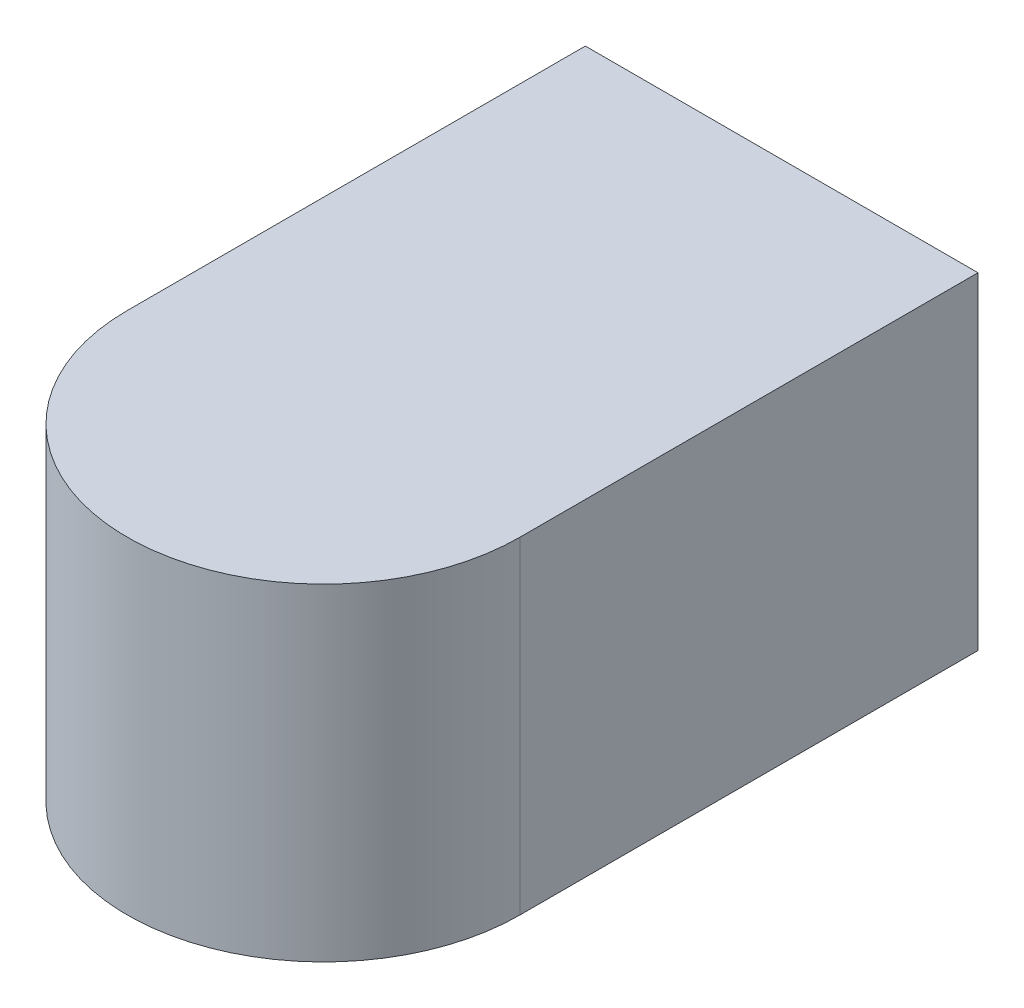
ISO-10303-21;
HEADER;
FILE_DESCRIPTION(('STEP AP214'),'2;1');
FILE_NAME('part.step','',(''),(''),'','','');
FILE_SCHEMA(('AUTOMOTIVE_DESIGN { 1 0 10303 214 1 1 1 1 }'));
ENDSEC;
DATA;
#1=APPLICATION_CONTEXT('core data for automotive mechanical design processes');
#2=APPLICATION_PROTOCOL_DEFINITION('international standard','automotive_design',2000,#1);
#3=PRODUCT_CONTEXT('',#1,'mechanical');
#4=PRODUCT('Part','Part','',(#3));
#5=PRODUCT_RELATED_PRODUCT_CATEGORY('part','',(#4));
#6=PRODUCT_DEFINITION_FORMATION('','',#4);
#7=PRODUCT_DEFINITION_CONTEXT('part definition',#1,'design');
#8=PRODUCT_DEFINITION('design','',#6,#7);
#9=PRODUCT_DEFINITION_SHAPE('','',#8);
#10=(LENGTH_UNIT() NAMED_UNIT(*) SI_UNIT(.MILLI.,.METRE.));
#11=(NAMED_UNIT(*) PLANE_ANGLE_UNIT() SI_UNIT($,.RADIAN.));
#12=(NAMED_UNIT(*) SI_UNIT($,.STERADIAN.) SOLID_ANGLE_UNIT());
#13=UNCERTAINTY_MEASURE_WITH_UNIT(LENGTH_MEASURE(1.E-05),#10,'distance_accuracy_value','');
#14=(GEOMETRIC_REPRESENTATION_CONTEXT(3) GLOBAL_UNCERTAINTY_ASSIGNED_CONTEXT((#13)) GLOBAL_UNIT_ASSIGNED_CONTEXT((#10,
#11,#12)) REPRESENTATION_CONTEXT('',''));
#15=CARTESIAN_POINT('',(0.,0.,0.));
#16=DIRECTION('',(0.,0.,1.));
#17=DIRECTION('',(1.,0.,0.));
#18=AXIS2_PLACEMENT_3D('',#15,#16,#17);
#19=CARTESIAN_POINT('',(0.,0.,0.));
#20=DIRECTION('',(0.,1.,0.));
#21=DIRECTION('',(1.,0.,0.));
#22=AXIS2_PLACEMENT_3D('',#19,#20,#21);
#23=PLANE('',#22);
#24=DIRECTION('',(-1.,0.,0.));
#25=VECTOR('',#24,1.);
#26=CARTESIAN_POINT('',(0.87,0.,-2.25));
#27=LINE('',#26,#25);
#28=CARTESIAN_POINT('',(0.87,0.,-2.25));
#29=VERTEX_POINT('',#28);
#30=CARTESIAN_POINT('',(0.63,0.,-2.25));
#31=VERTEX_POINT('',#30);
#32=EDGE_CURVE('E11',#29,#31,#27,.T.);
#33=ORIENTED_EDGE('',*,*,#32,.F.);
#34=DIRECTION('',(0.,0.,-1.));
#35=VECTOR('',#34,1.);
#36=CARTESIAN_POINT('',(0.87,0.,-1.97));
#37=LINE('',#36,#35);
#38=CARTESIAN_POINT('',(0.87,0.,-1.97));
#39=VERTEX_POINT('',#38);
#40=EDGE_CURVE('E24',#39,#29,#37,.T.);
#41=ORIENTED_EDGE('',*,*,#40,.F.);
#42=CARTESIAN_POINT('',(0.75,0.,-1.97));
#43=DIRECTION('',(0.,1.,0.));
#44=DIRECTION('',(-1.,0.,0.));
#45=AXIS2_PLACEMENT_3D('',#42,#43,#44);
#46=CIRCLE('',#45,0.12);
#47=CARTESIAN_POINT('',(0.63,0.,-1.97));
#48=VERTEX_POINT('',#47);
#49=EDGE_CURVE('E61',#48,#39,#46,.T.);
#50=ORIENTED_EDGE('',*,*,#49,.F.);
#51=DIRECTION('',(0.,0.,1.));
#52=VECTOR('',#51,1.);
#53=CARTESIAN_POINT('',(0.63,0.,-2.25));
#54=LINE('',#53,#52);
#55=EDGE_CURVE('E37',#31,#48,#54,.T.);
#56=ORIENTED_EDGE('',*,*,#55,.F.);
#57=EDGE_LOOP('',(#33,#41,#50,#56));
#58=FACE_BOUND('',#57,.T.);
#59=ADVANCED_FACE('F17',(#58),#23,.F.);
#60=CARTESIAN_POINT('',(0.63,0.,-2.25));
#61=DIRECTION('',(-1.,0.,0.));
#62=DIRECTION('',(0.,0.,1.));
#63=AXIS2_PLACEMENT_3D('',#60,#61,#62);
#64=PLANE('',#63);
#65=DIRECTION('',(0.,1.,0.));
#66=VECTOR('',#65,1.);
#67=CARTESIAN_POINT('',(0.63,0.,-1.97));
#68=LINE('',#67,#66);
#69=CARTESIAN_POINT('',(0.63,0.2,-1.97));
#70=VERTEX_POINT('',#69);
#71=EDGE_CURVE('E84',#48,#70,#68,.T.);
#72=ORIENTED_EDGE('',*,*,#71,.T.);
#73=DIRECTION('',(0.,0.,1.));
#74=VECTOR('',#73,1.);
#75=CARTESIAN_POINT('',(0.63,0.2,-2.25));
#76=LINE('',#75,#74);
#77=CARTESIAN_POINT('',(0.63,0.2,-2.25));
#78=VERTEX_POINT('',#77);
#79=EDGE_CURVE('E74',#78,#70,#76,.T.);
#80=ORIENTED_EDGE('',*,*,#79,.F.);
#81=DIRECTION('',(0.,1.,0.));
#82=VECTOR('',#81,1.);
#83=CARTESIAN_POINT('',(0.63,0.,-2.25));
#84=LINE('',#83,#82);
#85=EDGE_CURVE('E81',#31,#78,#84,.T.);
#86=ORIENTED_EDGE('',*,*,#85,.F.);
#87=ORIENTED_EDGE('',*,*,#55,.T.);
#88=EDGE_LOOP('',(#72,#80,#86,#87));
#89=FACE_BOUND('',#88,.T.);
#90=ADVANCED_FACE('F89',(#89),#64,.T.);
#91=CARTESIAN_POINT('',(0.87,0.,-2.25));
#92=DIRECTION('',(0.,0.,-1.));
#93=DIRECTION('',(-1.,0.,0.));
#94=AXIS2_PLACEMENT_3D('',#91,#92,#93);
#95=PLANE('',#94);
#96=ORIENTED_EDGE('',*,*,#85,.T.);
#97=DIRECTION('',(-1.,0.,0.));
#98=VECTOR('',#97,1.);
#99=CARTESIAN_POINT('',(0.87,0.2,-2.25));
#100=LINE('',#99,#98);
#101=CARTESIAN_POINT('',(0.87,0.2,-2.25));
#102=VERTEX_POINT('',#101);
#103=EDGE_CURVE('E79',#102,#78,#100,.T.);
#104=ORIENTED_EDGE('',*,*,#103,.F.);
#105=DIRECTION('',(0.,1.,0.));
#106=VECTOR('',#105,1.);
#107=CARTESIAN_POINT('',(0.87,0.,-2.25));
#108=LINE('',#107,#106);
#109=EDGE_CURVE('E67',#29,#102,#108,.T.);
#110=ORIENTED_EDGE('',*,*,#109,.F.);
#111=ORIENTED_EDGE('',*,*,#32,.T.);
#112=EDGE_LOOP('',(#96,#104,#110,#111));
#113=FACE_BOUND('',#112,.T.);
#114=ADVANCED_FACE('F91',(#113),#95,.T.);
#115=CARTESIAN_POINT('',(0.87,0.,-1.97));
#116=DIRECTION('',(1.,0.,0.));
#117=DIRECTION('',(0.,0.,-1.));
#118=AXIS2_PLACEMENT_3D('',#115,#116,#117);
#119=PLANE('',#118);
#120=ORIENTED_EDGE('',*,*,#109,.T.);
#121=DIRECTION('',(0.,0.,-1.));
#122=VECTOR('',#121,1.);
#123=CARTESIAN_POINT('',(0.87,0.2,-1.97));
#124=LINE('',#123,#122);
#125=CARTESIAN_POINT('',(0.87,0.2,-1.97));
#126=VERTEX_POINT('',#125);
#127=EDGE_CURVE('E62',#126,#102,#124,.T.);
#128=ORIENTED_EDGE('',*,*,#127,.F.);
#129=DIRECTION('',(0.,1.,0.));
#130=VECTOR('',#129,1.);
#131=CARTESIAN_POINT('',(0.87,0.,-1.97));
#132=LINE('',#131,#130);
#133=EDGE_CURVE('E55',#39,#126,#132,.T.);
#134=ORIENTED_EDGE('',*,*,#133,.F.);
#135=ORIENTED_EDGE('',*,*,#40,.T.);
#136=EDGE_LOOP('',(#120,#128,#134,#135));
#137=FACE_BOUND('',#136,.T.);
#138=ADVANCED_FACE('F65',(#137),#119,.T.);
#139=CARTESIAN_POINT('',(0.75,0.,-1.97));
#140=DIRECTION('',(0.,1.,0.));
#141=DIRECTION('',(1.,0.,0.));
#142=AXIS2_PLACEMENT_3D('',#139,#140,#141);
#143=CYLINDRICAL_SURFACE('',#142,0.12);
#144=ORIENTED_EDGE('',*,*,#133,.T.);
#145=CARTESIAN_POINT('',(0.75,0.2,-1.97));
#146=DIRECTION('',(0.,1.,0.));
#147=DIRECTION('',(-1.,0.,0.));
#148=AXIS2_PLACEMENT_3D('',#145,#146,#147);
#149=CIRCLE('',#148,0.12);
#150=EDGE_CURVE('E60',#70,#126,#149,.T.);
#151=ORIENTED_EDGE('',*,*,#150,.F.);
#152=ORIENTED_EDGE('',*,*,#71,.F.);
#153=ORIENTED_EDGE('',*,*,#49,.T.);
#154=EDGE_LOOP('',(#144,#151,#152,#153));
#155=FACE_BOUND('',#154,.T.);
#156=ADVANCED_FACE('F57',(#155),#143,.T.);
#157=CARTESIAN_POINT('',(0.,0.2,0.));
#158=DIRECTION('',(0.,1.,0.));
#159=DIRECTION('',(1.,0.,0.));
#160=AXIS2_PLACEMENT_3D('',#157,#158,#159);
#161=PLANE('',#160);
#162=ORIENTED_EDGE('',*,*,#150,.T.);
#163=ORIENTED_EDGE('',*,*,#127,.T.);
#164=ORIENTED_EDGE('',*,*,#103,.T.);
#165=ORIENTED_EDGE('',*,*,#79,.T.);
#166=EDGE_LOOP('',(#162,#163,#164,#165));
#167=FACE_BOUND('',#166,.T.);
#168=ADVANCED_FACE('F72',(#167),#161,.T.);
#169=CLOSED_SHELL('',(#59,#90,#114,#138,#156,#168));
#170=MANIFOLD_SOLID_BREP('B1',#169);
#171=ADVANCED_BREP_SHAPE_REPRESENTATION('',(#18,#170),#14);
#172=SHAPE_DEFINITION_REPRESENTATION(#9,#171);
ENDSEC;
END-ISO-10303-21;
